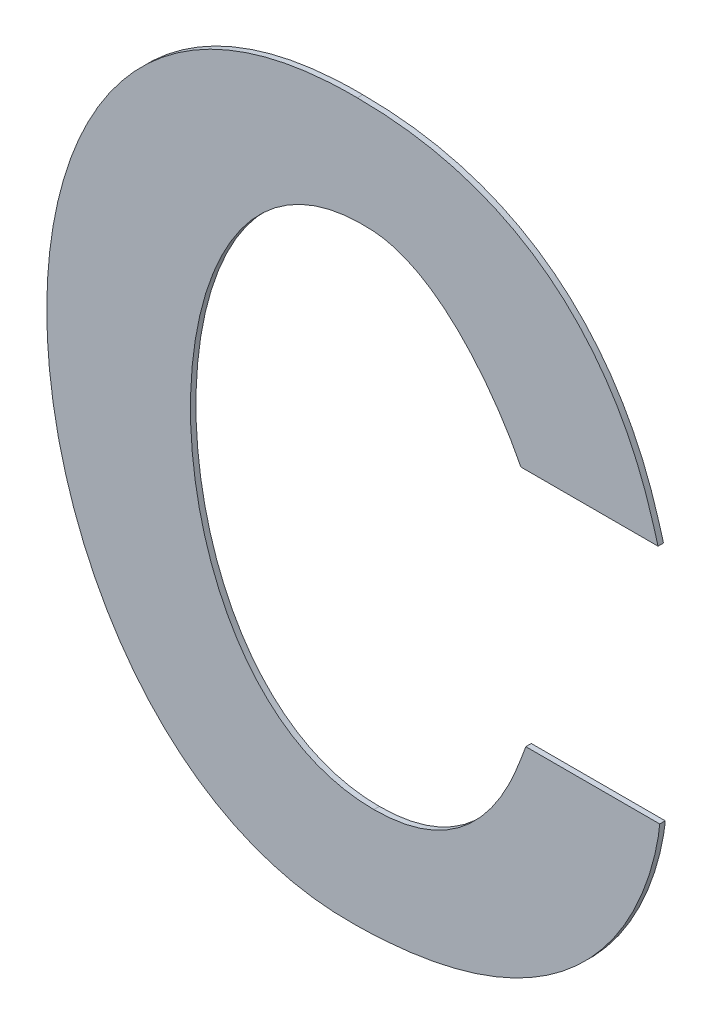
ISO-10303-21;
HEADER;
FILE_DESCRIPTION(('STEP AP214'),'2;1');
FILE_NAME('part.step','',(''),(''),'','','');
FILE_SCHEMA(('AUTOMOTIVE_DESIGN { 1 0 10303 214 1 1 1 1 }'));
ENDSEC;
DATA;
#1=APPLICATION_CONTEXT('core data for automotive mechanical design processes');
#2=APPLICATION_PROTOCOL_DEFINITION('international standard','automotive_design',2000,#1);
#3=PRODUCT_CONTEXT('',#1,'mechanical');
#4=PRODUCT('Part','Part','',(#3));
#5=PRODUCT_RELATED_PRODUCT_CATEGORY('part','',(#4));
#6=PRODUCT_DEFINITION_FORMATION('','',#4);
#7=PRODUCT_DEFINITION_CONTEXT('part definition',#1,'design');
#8=PRODUCT_DEFINITION('design','',#6,#7);
#9=PRODUCT_DEFINITION_SHAPE('','',#8);
#10=(LENGTH_UNIT() NAMED_UNIT(*) SI_UNIT(.MILLI.,.METRE.));
#11=(NAMED_UNIT(*) PLANE_ANGLE_UNIT() SI_UNIT($,.RADIAN.));
#12=(NAMED_UNIT(*) SI_UNIT($,.STERADIAN.) SOLID_ANGLE_UNIT());
#13=UNCERTAINTY_MEASURE_WITH_UNIT(LENGTH_MEASURE(1.E-05),#10,'distance_accuracy_value','');
#14=(GEOMETRIC_REPRESENTATION_CONTEXT(3) GLOBAL_UNCERTAINTY_ASSIGNED_CONTEXT((#13)) GLOBAL_UNIT_ASSIGNED_CONTEXT((#10,
#11,#12)) REPRESENTATION_CONTEXT('',''));
#15=CARTESIAN_POINT('',(0.,0.,0.));
#16=DIRECTION('',(0.,0.,1.));
#17=DIRECTION('',(1.,0.,0.));
#18=AXIS2_PLACEMENT_3D('',#15,#16,#17);
#19=CARTESIAN_POINT('',(-0.3300503861701,-0.1580350005202,0.00086146168299));
#20=CARTESIAN_POINT('',(-0.3300503861701,-0.1580350005202,-0.00057853831701));
#21=CARTESIAN_POINT('',(-0.4129198596541,-0.159852782519,0.00086146168299));
#22=CARTESIAN_POINT('',(-0.4129198596541,-0.159852782519,-0.00057853831701));
#23=CARTESIAN_POINT('',(-0.4274202112913,0.000119258281555989,0.00086146168299));
#24=CARTESIAN_POINT('',(-0.4274202112913,0.000119258281555989,-0.00057853831701));
#25=CARTESIAN_POINT('',(-0.3296963666233,-0.000964475024684012,0.00086146168299));
#26=CARTESIAN_POINT('',(-0.3296963666233,-0.000964475024684012,-0.00057853831701));
#27=B_SPLINE_SURFACE_WITH_KNOTS('',3,1,((#19,#20),(#21,#22),(#23,#24),(#25,#26)),.UNSPECIFIED.,
.F.,.F.,.F.,(4,4),(2,2),(0.,1.),(0.,0.00036),.UNSPECIFIED.);
#28=DIRECTION('',(0.,0.,1.));
#29=VECTOR('',#28,1.);
#30=CARTESIAN_POINT('',(-0.3300503861701,-0.1580350005202,-0.00033853831701));
#31=LINE('',#30,#29);
#32=CARTESIAN_POINT('',(-0.3300503861701,-0.1580350005202,-0.00033853831701));
#33=VERTEX_POINT('',#32);
#34=CARTESIAN_POINT('',(-0.3300503861701,-0.1580350005202,0.00086146168299));
#35=VERTEX_POINT('',#34);
#36=EDGE_CURVE('E11',#33,#35,#31,.T.);
#37=CARTESIAN_POINT('',(-0.3300503861701,-0.1580350005202,0.00086146168299));
#38=CARTESIAN_POINT('',(-0.4129198596541,-0.159852782519,0.00086146168299));
#39=CARTESIAN_POINT('',(-0.4274202112913,0.000119258281555989,0.00086146168299));
#40=CARTESIAN_POINT('',(-0.3296963666233,-0.000964475024684012,0.00086146168299));
#41=B_SPLINE_CURVE_WITH_KNOTS('',3,(#37,#38,#39,#40),.UNSPECIFIED.,.F.,.F.,(4,4),(0.,1.),.UNSPECIFIED.);
#42=CARTESIAN_POINT('',(-0.3296963666233,-0.000964475024684012,0.00086146168299));
#43=VERTEX_POINT('',#42);
#44=EDGE_CURVE('E26',#35,#43,#41,.T.);
#45=DIRECTION('',(0.,0.,1.));
#46=VECTOR('',#45,1.);
#47=CARTESIAN_POINT('',(-0.3296963666233,-0.000964475024684012,-0.00033853831701));
#48=LINE('',#47,#46);
#49=CARTESIAN_POINT('',(-0.3296963666233,-0.000964475024684012,-0.00033853831701));
#50=VERTEX_POINT('',#49);
#51=EDGE_CURVE('E237',#50,#43,#48,.T.);
#52=CARTESIAN_POINT('',(-0.3300503861701,-0.1580350005202,-0.00033853831701));
#53=CARTESIAN_POINT('',(-0.4129198596541,-0.159852782519,-0.00033853831701));
#54=CARTESIAN_POINT('',(-0.4274202112913,0.000119258281555989,-0.00033853831701));
#55=CARTESIAN_POINT('',(-0.3296963666233,-0.000964475024684012,-0.00033853831701));
#56=B_SPLINE_CURVE_WITH_KNOTS('',3,(#52,#53,#54,#55),.UNSPECIFIED.,.F.,.F.,(4,4),(0.,1.),.UNSPECIFIED.);
#57=EDGE_CURVE('E225',#33,#50,#56,.T.);
#58=ORIENTED_EDGE('',*,*,#36,.T.);
#59=ORIENTED_EDGE('',*,*,#44,.T.);
#60=ORIENTED_EDGE('',*,*,#51,.F.);
#61=ORIENTED_EDGE('',*,*,#57,.F.);
#62=EDGE_LOOP('',(#58,#59,#60,#61));
#63=FACE_BOUND('',#62,.T.);
#64=ADVANCED_FACE('F17',(#63),#27,.T.);
#65=CARTESIAN_POINT('',(-0.3296963666233,-0.000964475024684012,0.00086146168299));
#66=CARTESIAN_POINT('',(-0.3296963666233,-0.000964475024684012,-0.00057853831701));
#67=CARTESIAN_POINT('',(-0.2754013279809,-0.000964475024684012,0.00086146168299));
#68=CARTESIAN_POINT('',(-0.2754013279809,-0.000964475024684012,-0.00057853831701));
#69=CARTESIAN_POINT('',(-0.2659945228825,-0.0462045606494,0.00086146168299));
#70=CARTESIAN_POINT('',(-0.2659945228825,-0.0462045606494,-0.00057853831701));
#71=CARTESIAN_POINT('',(-0.2638270562701,-0.0530768747886,0.00086146168299));
#72=CARTESIAN_POINT('',(-0.2638270562701,-0.0530768747886,-0.00057853831701));
#73=B_SPLINE_SURFACE_WITH_KNOTS('',3,1,((#65,#66),(#67,#68),(#69,#70),(#71,#72)),.UNSPECIFIED.,
.F.,.F.,.F.,(4,4),(2,2),(0.,1.),(0.,0.00036),.UNSPECIFIED.);
#74=CARTESIAN_POINT('',(-0.3296963666233,-0.000964475024684012,0.00086146168299));
#75=CARTESIAN_POINT('',(-0.2754013279809,-0.000964475024684012,0.00086146168299));
#76=CARTESIAN_POINT('',(-0.2659945228825,-0.0462045606494,0.00086146168299));
#77=CARTESIAN_POINT('',(-0.2638270562701,-0.0530768747886,0.00086146168299));
#78=B_SPLINE_CURVE_WITH_KNOTS('',3,(#74,#75,#76,#77),.UNSPECIFIED.,.F.,.F.,(4,4),(0.,1.),.UNSPECIFIED.);
#79=CARTESIAN_POINT('',(-0.2638270562701,-0.0530768747886,0.00086146168299));
#80=VERTEX_POINT('',#79);
#81=EDGE_CURVE('E221',#43,#80,#78,.T.);
#82=DIRECTION('',(0.,0.,1.));
#83=VECTOR('',#82,1.);
#84=CARTESIAN_POINT('',(-0.2638270562701,-0.0530768747886,-0.00033853831701));
#85=LINE('',#84,#83);
#86=CARTESIAN_POINT('',(-0.2638270562701,-0.0530768747886,-0.00033853831701));
#87=VERTEX_POINT('',#86);
#88=EDGE_CURVE('E215',#87,#80,#85,.T.);
#89=CARTESIAN_POINT('',(-0.3296963666233,-0.000964475024684012,-0.00033853831701));
#90=CARTESIAN_POINT('',(-0.2754013279809,-0.000964475024684012,-0.00033853831701));
#91=CARTESIAN_POINT('',(-0.2659945228825,-0.0462045606494,-0.00033853831701));
#92=CARTESIAN_POINT('',(-0.2638270562701,-0.0530768747886,-0.00033853831701));
#93=B_SPLINE_CURVE_WITH_KNOTS('',3,(#89,#90,#91,#92),.UNSPECIFIED.,.F.,.F.,(4,4),(0.,1.),.UNSPECIFIED.);
#94=EDGE_CURVE('E210',#50,#87,#93,.T.);
#95=ORIENTED_EDGE('',*,*,#51,.T.);
#96=ORIENTED_EDGE('',*,*,#81,.T.);
#97=ORIENTED_EDGE('',*,*,#88,.F.);
#98=ORIENTED_EDGE('',*,*,#94,.F.);
#99=EDGE_LOOP('',(#95,#96,#97,#98));
#100=FACE_BOUND('',#99,.T.);
#101=ADVANCED_FACE('F252',(#100),#73,.T.);
#102=CARTESIAN_POINT('',(-0.2788475998947,-0.0530768747886,0.00086146168299));
#103=DIRECTION('',(0.,-1.,0.));
#104=DIRECTION('',(0.,0.,-1.));
#105=AXIS2_PLACEMENT_3D('',#102,#103,#104);
#106=PLANE('',#105);
#107=ORIENTED_EDGE('',*,*,#88,.T.);
#108=DIRECTION('',(-1.,0.,0.));
#109=VECTOR('',#108,1.);
#110=CARTESIAN_POINT('',(-0.2638270562701,-0.0530768747886,0.00086146168299));
#111=LINE('',#110,#109);
#112=CARTESIAN_POINT('',(-0.2938681435193,-0.0530768747886,0.00086146168299));
#113=VERTEX_POINT('',#112);
#114=EDGE_CURVE('E208',#80,#113,#111,.T.);
#115=ORIENTED_EDGE('',*,*,#114,.T.);
#116=DIRECTION('',(0.,0.,1.));
#117=VECTOR('',#116,1.);
#118=CARTESIAN_POINT('',(-0.2938681435193,-0.0530768747886,-0.00033853831701));
#119=LINE('',#118,#117);
#120=CARTESIAN_POINT('',(-0.2938681435193,-0.0530768747886,-0.00033853831701));
#121=VERTEX_POINT('',#120);
#122=EDGE_CURVE('E205',#121,#113,#119,.T.);
#123=ORIENTED_EDGE('',*,*,#122,.F.);
#124=DIRECTION('',(-1.,0.,0.));
#125=VECTOR('',#124,1.);
#126=CARTESIAN_POINT('',(-0.2638270562701,-0.0530768747886,-0.00033853831701));
#127=LINE('',#126,#125);
#128=EDGE_CURVE('E199',#87,#121,#127,.T.);
#129=ORIENTED_EDGE('',*,*,#128,.F.);
#130=EDGE_LOOP('',(#107,#115,#123,#129));
#131=FACE_BOUND('',#130,.T.);
#132=ADVANCED_FACE('F257',(#131),#106,.T.);
#133=CARTESIAN_POINT('',(-0.2938681435193,-0.0530768747886,0.00086146168299));
#134=CARTESIAN_POINT('',(-0.2938681435193,-0.0530768747886,-0.00057853831701));
#135=CARTESIAN_POINT('',(-0.2985715460681,-0.0436845194678,0.00086146168299));
#136=CARTESIAN_POINT('',(-0.2985715460681,-0.0436845194678,-0.00057853831701));
#137=CARTESIAN_POINT('',(-0.3108827564269,-0.025585450764716,0.00086146168299));
#138=CARTESIAN_POINT('',(-0.3108827564269,-0.025585450764716,-0.00057853831701));
#139=CARTESIAN_POINT('',(-0.3260622476033,-0.024485100214448,0.00086146168299));
#140=CARTESIAN_POINT('',(-0.3260622476033,-0.024485100214448,-0.00057853831701));
#141=B_SPLINE_SURFACE_WITH_KNOTS('',3,1,((#133,#134),(#135,#136),(#137,#138),(#139,#140)),
.UNSPECIFIED.,.F.,.F.,.F.,(4,4),(2,2),(0.,1.),(0.,0.00036),.UNSPECIFIED.);
#142=CARTESIAN_POINT('',(-0.2938681435193,-0.0530768747886,0.00086146168299));
#143=CARTESIAN_POINT('',(-0.2985715460681,-0.0436845194678,0.00086146168299));
#144=CARTESIAN_POINT('',(-0.3108827564269,-0.025585450764716,0.00086146168299));
#145=CARTESIAN_POINT('',(-0.3260622476033,-0.024485100214448,0.00086146168299));
#146=B_SPLINE_CURVE_WITH_KNOTS('',3,(#142,#143,#144,#145),.UNSPECIFIED.,.F.,.F.,(4,4),(0.,1.),.UNSPECIFIED.);
#147=CARTESIAN_POINT('',(-0.3260622476033,-0.024485100214448,0.00086146168299));
#148=VERTEX_POINT('',#147);
#149=EDGE_CURVE('E195',#113,#148,#146,.T.);
#150=DIRECTION('',(0.,0.,1.));
#151=VECTOR('',#150,1.);
#152=CARTESIAN_POINT('',(-0.3260622476033,-0.024485100214448,-0.00033853831701));
#153=LINE('',#152,#151);
#154=CARTESIAN_POINT('',(-0.3260622476033,-0.024485100214448,-0.00033853831701));
#155=VERTEX_POINT('',#154);
#156=EDGE_CURVE('E189',#155,#148,#153,.T.);
#157=CARTESIAN_POINT('',(-0.2938681435193,-0.0530768747886,-0.00033853831701));
#158=CARTESIAN_POINT('',(-0.2985715460681,-0.0436845194678,-0.00033853831701));
#159=CARTESIAN_POINT('',(-0.3108827564269,-0.025585450764716,-0.00033853831701));
#160=CARTESIAN_POINT('',(-0.3260622476033,-0.024485100214448,-0.00033853831701));
#161=B_SPLINE_CURVE_WITH_KNOTS('',3,(#157,#158,#159,#160),.UNSPECIFIED.,.F.,.F.,(4,4),(0.,1.),.UNSPECIFIED.);
#162=EDGE_CURVE('E181',#121,#155,#161,.T.);
#163=ORIENTED_EDGE('',*,*,#122,.T.);
#164=ORIENTED_EDGE('',*,*,#149,.T.);
#165=ORIENTED_EDGE('',*,*,#156,.F.);
#166=ORIENTED_EDGE('',*,*,#162,.F.);
#167=EDGE_LOOP('',(#163,#164,#165,#166));
#168=FACE_BOUND('',#167,.T.);
#169=ADVANCED_FACE('F261',(#168),#141,.T.);
#170=CARTESIAN_POINT('',(-0.3260622476033,-0.024485100214448,0.00086146168299));
#171=CARTESIAN_POINT('',(-0.3260622476033,-0.024485100214448,-0.00057853831701));
#172=CARTESIAN_POINT('',(-0.3796275724861,-0.020880603237892,0.00086146168299));
#173=CARTESIAN_POINT('',(-0.3796275724861,-0.020880603237892,-0.00057853831701));
#174=CARTESIAN_POINT('',(-0.3796275724861,-0.134148073473,0.00086146168299));
#175=CARTESIAN_POINT('',(-0.3796275724861,-0.134148073473,-0.00057853831701));
#176=CARTESIAN_POINT('',(-0.3260622476033,-0.134148073473,0.00086146168299));
#177=CARTESIAN_POINT('',(-0.3260622476033,-0.134148073473,-0.00057853831701));
#178=B_SPLINE_SURFACE_WITH_KNOTS('',3,1,((#170,#171),(#172,#173),(#174,#175),(#176,#177)),
.UNSPECIFIED.,.F.,.F.,.F.,(4,4),(2,2),(0.,1.),(0.,0.00036),.UNSPECIFIED.);
#179=CARTESIAN_POINT('',(-0.3260622476033,-0.024485100214448,0.00086146168299));
#180=CARTESIAN_POINT('',(-0.3796275724861,-0.020880603237892,0.00086146168299));
#181=CARTESIAN_POINT('',(-0.3796275724861,-0.134148073473,0.00086146168299));
#182=CARTESIAN_POINT('',(-0.3260622476033,-0.134148073473,0.00086146168299));
#183=B_SPLINE_CURVE_WITH_KNOTS('',3,(#179,#180,#181,#182),.UNSPECIFIED.,.F.,.F.,(4,4),(0.,1.),.UNSPECIFIED.);
#184=CARTESIAN_POINT('',(-0.3260622476033,-0.134148073473,0.00086146168299));
#185=VERTEX_POINT('',#184);
#186=EDGE_CURVE('E177',#148,#185,#183,.T.);
#187=DIRECTION('',(0.,0.,1.));
#188=VECTOR('',#187,1.);
#189=CARTESIAN_POINT('',(-0.3260622476033,-0.134148073473,-0.00033853831701));
#190=LINE('',#189,#188);
#191=CARTESIAN_POINT('',(-0.3260622476033,-0.134148073473,-0.00033853831701));
#192=VERTEX_POINT('',#191);
#193=EDGE_CURVE('E171',#192,#185,#190,.T.);
#194=CARTESIAN_POINT('',(-0.3260622476033,-0.024485100214448,-0.00033853831701));
#195=CARTESIAN_POINT('',(-0.3796275724861,-0.020880603237892,-0.00033853831701));
#196=CARTESIAN_POINT('',(-0.3796275724861,-0.134148073473,-0.00033853831701));
#197=CARTESIAN_POINT('',(-0.3260622476033,-0.134148073473,-0.00033853831701));
#198=B_SPLINE_CURVE_WITH_KNOTS('',3,(#194,#195,#196,#197),.UNSPECIFIED.,.F.,.F.,(4,4),(0.,1.),.UNSPECIFIED.);
#199=EDGE_CURVE('E164',#155,#192,#198,.T.);
#200=ORIENTED_EDGE('',*,*,#156,.T.);
#201=ORIENTED_EDGE('',*,*,#186,.T.);
#202=ORIENTED_EDGE('',*,*,#193,.F.);
#203=ORIENTED_EDGE('',*,*,#199,.F.);
#204=EDGE_LOOP('',(#200,#201,#202,#203));
#205=FACE_BOUND('',#204,.T.);
#206=ADVANCED_FACE('F264',(#205),#178,.T.);
#207=CARTESIAN_POINT('',(-0.3260622476033,-0.134148073473,0.00086146168299));
#208=CARTESIAN_POINT('',(-0.3260622476033,-0.134148073473,-0.00057853831701));
#209=CARTESIAN_POINT('',(-0.3003705433565,-0.134148073473,0.00086146168299));
#210=CARTESIAN_POINT('',(-0.3003705433565,-0.134148073473,-0.00057853831701));
#211=CARTESIAN_POINT('',(-0.2942149381773,-0.108457091715,0.00086146168299));
#212=CARTESIAN_POINT('',(-0.2942149381773,-0.108457091715,-0.00057853831701));
#213=CARTESIAN_POINT('',(-0.2927844102129,-0.1055700261874,0.00086146168299));
#214=CARTESIAN_POINT('',(-0.2927844102129,-0.1055700261874,-0.00057853831701));
#215=B_SPLINE_SURFACE_WITH_KNOTS('',3,1,((#207,#208),(#209,#210),(#211,#212),(#213,#214)),
.UNSPECIFIED.,.F.,.F.,.F.,(4,4),(2,2),(0.,1.),(0.,0.00036),.UNSPECIFIED.);
#216=CARTESIAN_POINT('',(-0.3260622476033,-0.134148073473,0.00086146168299));
#217=CARTESIAN_POINT('',(-0.3003705433565,-0.134148073473,0.00086146168299));
#218=CARTESIAN_POINT('',(-0.2942149381773,-0.108457091715,0.00086146168299));
#219=CARTESIAN_POINT('',(-0.2927844102129,-0.1055700261874,0.00086146168299));
#220=B_SPLINE_CURVE_WITH_KNOTS('',3,(#216,#217,#218,#219),.UNSPECIFIED.,.F.,.F.,(4,4),(0.,1.),.UNSPECIFIED.);
#221=CARTESIAN_POINT('',(-0.2927844102129,-0.1055700261874,0.00086146168299));
#222=VERTEX_POINT('',#221);
#223=EDGE_CURVE('E160',#185,#222,#220,.T.);
#224=DIRECTION('',(0.,0.,1.));
#225=VECTOR('',#224,1.);
#226=CARTESIAN_POINT('',(-0.2927844102129,-0.1055700261874,-0.00033853831701));
#227=LINE('',#226,#225);
#228=CARTESIAN_POINT('',(-0.2927844102129,-0.1055700261874,-0.00033853831701));
#229=VERTEX_POINT('',#228);
#230=EDGE_CURVE('E155',#229,#222,#227,.T.);
#231=CARTESIAN_POINT('',(-0.3260622476033,-0.134148073473,-0.00033853831701));
#232=CARTESIAN_POINT('',(-0.3003705433565,-0.134148073473,-0.00033853831701));
#233=CARTESIAN_POINT('',(-0.2942149381773,-0.108457091715,-0.00033853831701));
#234=CARTESIAN_POINT('',(-0.2927844102129,-0.1055700261874,-0.00033853831701));
#235=B_SPLINE_CURVE_WITH_KNOTS('',3,(#231,#232,#233,#234),.UNSPECIFIED.,.F.,.F.,(4,4),(0.,1.),.UNSPECIFIED.);
#236=EDGE_CURVE('E98',#192,#229,#235,.T.);
#237=ORIENTED_EDGE('',*,*,#193,.T.);
#238=ORIENTED_EDGE('',*,*,#223,.T.);
#239=ORIENTED_EDGE('',*,*,#230,.F.);
#240=ORIENTED_EDGE('',*,*,#236,.F.);
#241=EDGE_LOOP('',(#237,#238,#239,#240));
#242=FACE_BOUND('',#241,.T.);
#243=ADVANCED_FACE('F267',(#242),#215,.T.);
#244=CARTESIAN_POINT('',(-0.2781214985795,-0.1055700261874,0.00086146168299));
#245=DIRECTION('',(0.,1.,0.));
#246=DIRECTION('',(0.,0.,1.));
#247=AXIS2_PLACEMENT_3D('',#244,#245,#246);
#248=PLANE('',#247);
#249=ORIENTED_EDGE('',*,*,#230,.T.);
#250=DIRECTION('',(1.,0.,0.));
#251=VECTOR('',#250,1.);
#252=CARTESIAN_POINT('',(-0.2927844102129,-0.1055700261874,0.00086146168299));
#253=LINE('',#252,#251);
#254=CARTESIAN_POINT('',(-0.2634585869461,-0.1055700261874,0.00086146168299));
#255=VERTEX_POINT('',#254);
#256=EDGE_CURVE('E86',#222,#255,#253,.T.);
#257=ORIENTED_EDGE('',*,*,#256,.T.);
#258=DIRECTION('',(0.,0.,1.));
#259=VECTOR('',#258,1.);
#260=CARTESIAN_POINT('',(-0.2634585869461,-0.1055700261874,-0.00033853831701));
#261=LINE('',#260,#259);
#262=CARTESIAN_POINT('',(-0.2634585869461,-0.1055700261874,-0.00033853831701));
#263=VERTEX_POINT('',#262);
#264=EDGE_CURVE('E80',#263,#255,#261,.T.);
#265=ORIENTED_EDGE('',*,*,#264,.F.);
#266=DIRECTION('',(1.,0.,0.));
#267=VECTOR('',#266,1.);
#268=CARTESIAN_POINT('',(-0.2927844102129,-0.1055700261874,-0.00033853831701));
#269=LINE('',#268,#267);
#270=EDGE_CURVE('E84',#229,#263,#269,.T.);
#271=ORIENTED_EDGE('',*,*,#270,.F.);
#272=EDGE_LOOP('',(#249,#257,#265,#271));
#273=FACE_BOUND('',#272,.T.);
#274=ADVANCED_FACE('F83',(#273),#248,.T.);
#275=CARTESIAN_POINT('',(-0.2634585869461,-0.1055700261874,0.00086146168299));
#276=CARTESIAN_POINT('',(-0.2634585869461,-0.1055700261874,-0.00057853831701));
#277=CARTESIAN_POINT('',(-0.2634585869461,-0.105923323245,0.00086146168299));
#278=CARTESIAN_POINT('',(-0.2634585869461,-0.105923323245,-0.00057853831701));
#279=CARTESIAN_POINT('',(-0.2670927059661,-0.1573182915602,0.00086146168299));
#280=CARTESIAN_POINT('',(-0.2670927059661,-0.1573182915602,-0.00057853831701));
#281=CARTESIAN_POINT('',(-0.3300503861701,-0.1580350005202,0.00086146168299));
#282=CARTESIAN_POINT('',(-0.3300503861701,-0.1580350005202,-0.00057853831701));
#283=B_SPLINE_SURFACE_WITH_KNOTS('',3,1,((#275,#276),(#277,#278),(#279,#280),(#281,#282)),
.UNSPECIFIED.,.F.,.F.,.F.,(4,4),(2,2),(0.,1.),(0.,0.00036),.UNSPECIFIED.);
#284=CARTESIAN_POINT('',(-0.2634585869461,-0.1055700261874,0.00086146168299));
#285=CARTESIAN_POINT('',(-0.2634585869461,-0.105923323245,0.00086146168299));
#286=CARTESIAN_POINT('',(-0.2670927059661,-0.1573182915602,0.00086146168299));
#287=CARTESIAN_POINT('',(-0.3300503861701,-0.1580350005202,0.00086146168299));
#288=B_SPLINE_CURVE_WITH_KNOTS('',3,(#284,#285,#286,#287),.UNSPECIFIED.,.F.,.F.,(4,4),(0.,1.),.UNSPECIFIED.);
#289=EDGE_CURVE('E99',#255,#35,#288,.T.);
#290=CARTESIAN_POINT('',(-0.3300503861701,-0.1580350005202,-0.00033853831701));
#291=CARTESIAN_POINT('',(-0.2670927059661,-0.1573182915602,-0.00033853831701));
#292=CARTESIAN_POINT('',(-0.2634585869461,-0.105923323245,-0.00033853831701));
#293=CARTESIAN_POINT('',(-0.2634585869461,-0.1055700261874,-0.00033853831701));
#294=B_SPLINE_CURVE_WITH_KNOTS('',3,(#290,#291,#292,#293),.UNSPECIFIED.,.F.,.F.,(4,4),(0.,1.),.UNSPECIFIED.);
#295=EDGE_CURVE('E94',#263,#33,#294,.F.);
#296=ORIENTED_EDGE('',*,*,#264,.T.);
#297=ORIENTED_EDGE('',*,*,#289,.T.);
#298=ORIENTED_EDGE('',*,*,#36,.F.);
#299=ORIENTED_EDGE('',*,*,#295,.F.);
#300=EDGE_LOOP('',(#296,#297,#298,#299));
#301=FACE_BOUND('',#300,.T.);
#302=ADVANCED_FACE('F102',(#301),#283,.T.);
#303=CARTESIAN_POINT('',(-0.3454393991187,-0.159852782519,-0.00033853831701));
#304=DIRECTION('',(0.,0.,1.));
#305=DIRECTION('',(1.,0.,0.));
#306=AXIS2_PLACEMENT_3D('',#303,#304,#305);
#307=PLANE('',#306);
#308=ORIENTED_EDGE('',*,*,#57,.T.);
#309=ORIENTED_EDGE('',*,*,#94,.T.);
#310=ORIENTED_EDGE('',*,*,#128,.T.);
#311=ORIENTED_EDGE('',*,*,#162,.T.);
#312=ORIENTED_EDGE('',*,*,#199,.T.);
#313=ORIENTED_EDGE('',*,*,#236,.T.);
#314=ORIENTED_EDGE('',*,*,#270,.T.);
#315=ORIENTED_EDGE('',*,*,#295,.T.);
#316=EDGE_LOOP('',(#308,#309,#310,#311,#312,#313,#314,#315));
#317=FACE_BOUND('',#316,.T.);
#318=ADVANCED_FACE('F93',(#317),#307,.F.);
#319=CARTESIAN_POINT('',(-0.3454393991187,-0.159852782519,0.00086146168299));
#320=DIRECTION('',(0.,0.,1.));
#321=DIRECTION('',(1.,0.,0.));
#322=AXIS2_PLACEMENT_3D('',#319,#320,#321);
#323=PLANE('',#322);
#324=ORIENTED_EDGE('',*,*,#44,.F.);
#325=ORIENTED_EDGE('',*,*,#289,.F.);
#326=ORIENTED_EDGE('',*,*,#256,.F.);
#327=ORIENTED_EDGE('',*,*,#223,.F.);
#328=ORIENTED_EDGE('',*,*,#186,.F.);
#329=ORIENTED_EDGE('',*,*,#149,.F.);
#330=ORIENTED_EDGE('',*,*,#114,.F.);
#331=ORIENTED_EDGE('',*,*,#81,.F.);
#332=EDGE_LOOP('',(#324,#325,#326,#327,#328,#329,#330,#331));
#333=FACE_BOUND('',#332,.T.);
#334=ADVANCED_FACE('F120',(#333),#323,.T.);
#335=CLOSED_SHELL('',(#64,#101,#132,#169,#206,#243,#274,#302,#318,#334));
#336=MANIFOLD_SOLID_BREP('B1',#335);
#337=ADVANCED_BREP_SHAPE_REPRESENTATION('',(#18,#336),#14);
#338=SHAPE_DEFINITION_REPRESENTATION(#9,#337);
ENDSEC;
END-ISO-10303-21;
